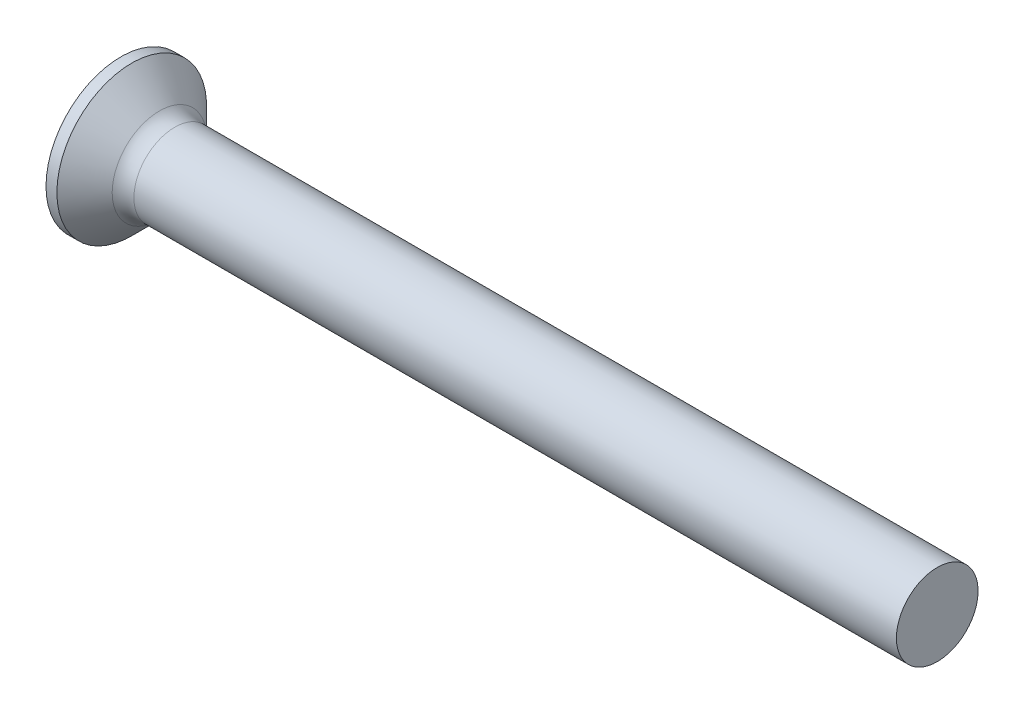
ISO-10303-21;
HEADER;
FILE_DESCRIPTION(('STEP AP214'),'2;1');
FILE_NAME('part.step','',(''),(''),'','','');
FILE_SCHEMA(('AUTOMOTIVE_DESIGN { 1 0 10303 214 1 1 1 1 }'));
ENDSEC;
DATA;
#1=APPLICATION_CONTEXT('core data for automotive mechanical design processes');
#2=APPLICATION_PROTOCOL_DEFINITION('international standard','automotive_design',2000,#1);
#3=PRODUCT_CONTEXT('',#1,'mechanical');
#4=PRODUCT('Part','Part','',(#3));
#5=PRODUCT_RELATED_PRODUCT_CATEGORY('part','',(#4));
#6=PRODUCT_DEFINITION_FORMATION('','',#4);
#7=PRODUCT_DEFINITION_CONTEXT('part definition',#1,'design');
#8=PRODUCT_DEFINITION('design','',#6,#7);
#9=PRODUCT_DEFINITION_SHAPE('','',#8);
#10=(LENGTH_UNIT() NAMED_UNIT(*) SI_UNIT(.MILLI.,.METRE.));
#11=(NAMED_UNIT(*) PLANE_ANGLE_UNIT() SI_UNIT($,.RADIAN.));
#12=(NAMED_UNIT(*) SI_UNIT($,.STERADIAN.) SOLID_ANGLE_UNIT());
#13=UNCERTAINTY_MEASURE_WITH_UNIT(LENGTH_MEASURE(1.E-05),#10,'distance_accuracy_value','');
#14=(GEOMETRIC_REPRESENTATION_CONTEXT(3) GLOBAL_UNCERTAINTY_ASSIGNED_CONTEXT((#13)) GLOBAL_UNIT_ASSIGNED_CONTEXT((#10,
#11,#12)) REPRESENTATION_CONTEXT('',''));
#15=CARTESIAN_POINT('',(0.,0.,0.));
#16=DIRECTION('',(0.,0.,1.));
#17=DIRECTION('',(1.,0.,0.));
#18=AXIS2_PLACEMENT_3D('',#15,#16,#17);
#19=CARTESIAN_POINT('',(2.01,0.370000000000002,-0.49785100239185));
#20=DIRECTION('',(-0.446197800778958,0.,0.89493436774996));
#21=DIRECTION('',(0.89493436774996,0.,0.446197800778958));
#22=AXIS2_PLACEMENT_3D('',#19,#20,#21);
#23=PLANE('',#22);
#24=DIRECTION('',(0.,1.,0.));
#25=VECTOR('',#24,1.);
#26=CARTESIAN_POINT('',(0.,0.370000000000002,-1.5));
#27=LINE('',#26,#25);
#28=CARTESIAN_POINT('',(0.,0.370000000000005,-1.5));
#29=VERTEX_POINT('',#28);
#30=CARTESIAN_POINT('',(0.,-0.369999999999995,-1.5));
#31=VERTEX_POINT('',#30);
#32=EDGE_CURVE('E175',#29,#31,#27,.F.);
#33=ORIENTED_EDGE('',*,*,#32,.T.);
#34=DIRECTION('',(-0.89493436774996,0.,-0.446197800778958));
#35=VECTOR('',#34,1.);
#36=CARTESIAN_POINT('',(2.01,-0.369999999999999,-0.497851002391852));
#37=LINE('',#36,#35);
#38=CARTESIAN_POINT('',(2.01,-0.369999999999998,-0.497851002391852));
#39=VERTEX_POINT('',#38);
#40=EDGE_CURVE('E203',#39,#31,#37,.T.);
#41=ORIENTED_EDGE('',*,*,#40,.F.);
#42=DIRECTION('',(0.,1.,0.));
#43=VECTOR('',#42,1.);
#44=CARTESIAN_POINT('',(2.01,0.370000000000002,-0.49785100239185));
#45=LINE('',#44,#43);
#46=CARTESIAN_POINT('',(2.00999999999998,-0.247548741500632,-0.497851002391852));
#47=VERTEX_POINT('',#46);
#48=EDGE_CURVE('E186',#39,#47,#45,.T.);
#49=ORIENTED_EDGE('',*,*,#48,.T.);
#50=CARTESIAN_POINT('',(2.86902882958261,0.,-0.0695550419526875));
#51=DIRECTION('',(-0.446197800778958,0.,0.89493436774996));
#52=DIRECTION('',(-0.89493436774996,0.,-0.446197800778958));
#53=AXIS2_PLACEMENT_3D('',#50,#51,#52);
#54=ELLIPSE('',#53,1.11145965244602,0.491029028343212);
#55=CARTESIAN_POINT('',(2.01,0.247548741500636,-0.497851002391851));
#56=VERTEX_POINT('',#55);
#57=EDGE_CURVE('E20',#47,#56,#54,.F.);
#58=ORIENTED_EDGE('',*,*,#57,.T.);
#59=DIRECTION('',(0.,1.,0.));
#60=VECTOR('',#59,1.);
#61=CARTESIAN_POINT('',(2.01,0.370000000000002,-0.49785100239185));
#62=LINE('',#61,#60);
#63=CARTESIAN_POINT('',(2.01,0.370000000000002,-0.49785100239185));
#64=VERTEX_POINT('',#63);
#65=EDGE_CURVE('E167',#56,#64,#62,.T.);
#66=ORIENTED_EDGE('',*,*,#65,.T.);
#67=DIRECTION('',(0.89493436774996,0.,0.446197800778958));
#68=VECTOR('',#67,1.);
#69=CARTESIAN_POINT('',(0.,0.370000000000005,-1.5));
#70=LINE('',#69,#68);
#71=EDGE_CURVE('E193',#29,#64,#70,.T.);
#72=ORIENTED_EDGE('',*,*,#71,.F.);
#73=EDGE_LOOP('',(#33,#41,#49,#58,#66,#72));
#74=FACE_BOUND('',#73,.T.);
#75=ADVANCED_FACE('F17',(#74),#23,.T.);
#76=CARTESIAN_POINT('',(2.01,-0.369999999999999,-0.497851002391852));
#77=DIRECTION('',(0.,1.,0.));
#78=DIRECTION('',(0.,0.,1.));
#79=AXIS2_PLACEMENT_3D('',#76,#77,#78);
#80=PLANE('',#79);
#81=DIRECTION('',(0.,0.,1.));
#82=VECTOR('',#81,1.);
#83=CARTESIAN_POINT('',(2.01,-0.369999999999999,-0.497851002391852));
#84=LINE('',#83,#82);
#85=CARTESIAN_POINT('',(2.00999999999215,-0.369999999999999,-0.415013252802522));
#86=VERTEX_POINT('',#85);
#87=EDGE_CURVE('E206',#86,#39,#84,.F.);
#88=ORIENTED_EDGE('',*,*,#87,.T.);
#89=ORIENTED_EDGE('',*,*,#40,.T.);
#90=DIRECTION('',(0.,0.,1.));
#91=VECTOR('',#90,1.);
#92=CARTESIAN_POINT('',(0.,-0.369999999999999,-0.497851002391852));
#93=LINE('',#92,#91);
#94=CARTESIAN_POINT('',(0.,-0.369999999999998,-0.590157547919396));
#95=VERTEX_POINT('',#94);
#96=EDGE_CURVE('E200',#31,#95,#93,.T.);
#97=ORIENTED_EDGE('',*,*,#96,.T.);
#98=CARTESIAN_POINT('',(1.8304273123974E-13,-0.369999999999998,-0.590157547919381));
#99=CARTESIAN_POINT('',(0.216309052140947,-0.369999999999998,-0.572289577009795));
#100=CARTESIAN_POINT('',(0.432602407240752,-0.369999999999998,-0.55422283720754));
#101=CARTESIAN_POINT('',(0.865134686024455,-0.369999999999999,-0.51747646673141));
#102=CARTESIAN_POINT('',(1.08137361024975,-0.369999999999999,-0.498796842417631));
#103=CARTESIAN_POINT('',(1.41633940967486,-0.369999999999999,-0.469214323587316));
#104=CARTESIAN_POINT('',(1.53509176406674,-0.369999999999999,-0.458600717042247));
#105=CARTESIAN_POINT('',(1.77256859362964,-0.369999999999999,-0.437058976884605));
#106=CARTESIAN_POINT('',(1.89129306863835,-0.369999999999999,-0.426130841484444));
#107=CARTESIAN_POINT('',(2.00999999999512,-0.369999999999999,-0.41501325280501));
#108=B_SPLINE_CURVE_WITH_KNOTS('',3,(#98,#99,#100,#101,#102,#103,#104,#105,#106,#107),
.UNSPECIFIED.,.F.,.F.,(4,2,2,2,4),(0.,0.651138391205932,1.30227002747919,1.65994677859564,
2.01762556292617),.UNSPECIFIED.);
#109=EDGE_CURVE('E444',#95,#86,#108,.T.);
#110=ORIENTED_EDGE('',*,*,#109,.T.);
#111=EDGE_LOOP('',(#88,#89,#97,#110));
#112=FACE_BOUND('',#111,.T.);
#113=ADVANCED_FACE('F462',(#112),#80,.T.);
#114=CARTESIAN_POINT('',(2.01,0.369999999999998,0.497851002391852));
#115=DIRECTION('',(0.,-1.,0.));
#116=DIRECTION('',(0.,0.,-1.));
#117=AXIS2_PLACEMENT_3D('',#114,#115,#116);
#118=PLANE('',#117);
#119=DIRECTION('',(0.,0.,-1.));
#120=VECTOR('',#119,1.);
#121=CARTESIAN_POINT('',(0.,0.369999999999998,0.497851002391852));
#122=LINE('',#121,#120);
#123=CARTESIAN_POINT('',(0.,0.370000000000001,-0.590157547919387));
#124=VERTEX_POINT('',#123);
#125=EDGE_CURVE('E196',#124,#29,#122,.T.);
#126=ORIENTED_EDGE('',*,*,#125,.T.);
#127=ORIENTED_EDGE('',*,*,#71,.T.);
#128=DIRECTION('',(0.,0.,-1.));
#129=VECTOR('',#128,1.);
#130=CARTESIAN_POINT('',(2.01,0.369999999999998,0.497851002391852));
#131=LINE('',#130,#129);
#132=CARTESIAN_POINT('',(2.00999999999215,0.370000000000002,-0.41501325280252));
#133=VERTEX_POINT('',#132);
#134=EDGE_CURVE('E171',#64,#133,#131,.F.);
#135=ORIENTED_EDGE('',*,*,#134,.T.);
#136=CARTESIAN_POINT('',(2.00999999999499,0.370000000000002,-0.415013252803601));
#137=CARTESIAN_POINT('',(1.83750309020829,0.370000000000002,-0.431158569065824));
#138=CARTESIAN_POINT('',(1.66497088180432,0.370000000000002,-0.446919712843423));
#139=CARTESIAN_POINT('',(1.31985329581661,0.370000000000002,-0.477835113087158));
#140=CARTESIAN_POINT('',(1.14726791863695,0.370000000000002,-0.492989374056398));
#141=CARTESIAN_POINT('',(0.812249302666097,0.370000000000002,-0.521971147103273));
#142=CARTESIAN_POINT('',(0.649818258439769,0.370000000000001,-0.535824167251821));
#143=CARTESIAN_POINT('',(0.324928129773506,0.370000000000001,-0.563211285368423));
#144=CARTESIAN_POINT('',(0.162469045147424,0.370000000000001,-0.576745381130288));
#145=CARTESIAN_POINT('',(2.04026034606491E-13,0.370000000000001,-0.590157547919622));
#146=B_SPLINE_CURVE_WITH_KNOTS('',3,(#136,#137,#138,#139,#140,#141,#142,#143,#144,#145),
.UNSPECIFIED.,.F.,.F.,(4,2,2,2,4),(0.,0.519751169069005,1.03949848084209,1.52856030580364,
2.01762551290344),.UNSPECIFIED.);
#147=EDGE_CURVE('E441',#133,#124,#146,.T.);
#148=ORIENTED_EDGE('',*,*,#147,.T.);
#149=EDGE_LOOP('',(#126,#127,#135,#148));
#150=FACE_BOUND('',#149,.T.);
#151=ADVANCED_FACE('F483',(#150),#118,.T.);
#152=CARTESIAN_POINT('',(0.,0.,0.));
#153=DIRECTION('',(-1.,0.,0.));
#154=DIRECTION('',(0.,0.,1.));
#155=AXIS2_PLACEMENT_3D('',#152,#153,#154);
#156=CONICAL_SURFACE('',#155,0.696552892009095,0.0698131700800835);
#157=ORIENTED_EDGE('',*,*,#109,.F.);
#158=CARTESIAN_POINT('',(0.,0.,0.));
#159=DIRECTION('',(-1.,0.,0.));
#160=DIRECTION('',(0.,0.,1.));
#161=AXIS2_PLACEMENT_3D('',#158,#159,#160);
#162=CIRCLE('',#161,0.696552892009095);
#163=CARTESIAN_POINT('',(0.,-0.590157547919396,-0.369999999999999));
#164=VERTEX_POINT('',#163);
#165=EDGE_CURVE('E195',#164,#95,#162,.F.);
#166=ORIENTED_EDGE('',*,*,#165,.F.);
#167=CARTESIAN_POINT('',(2.00999999999762,-0.415013252803356,-0.37));
#168=CARTESIAN_POINT('',(1.83750309021098,-0.431158569065578,-0.37));
#169=CARTESIAN_POINT('',(1.66497088180707,-0.446919712843175,-0.37));
#170=CARTESIAN_POINT('',(1.31985329581947,-0.477835113086907,-0.37));
#171=CARTESIAN_POINT('',(1.14726791863987,-0.492989374056144,-0.37));
#172=CARTESIAN_POINT('',(0.812249302668581,-0.521971147103062,-0.37));
#173=CARTESIAN_POINT('',(0.649818258441765,-0.535824167251653,-0.37));
#174=CARTESIAN_POINT('',(0.324928129774522,-0.563211285368339,-0.37));
#175=CARTESIAN_POINT('',(0.162469045147951,-0.576745381130245,-0.369999999999999));
#176=CARTESIAN_POINT('',(2.40997336507689E-13,-0.59015754791962,-0.369999999999999));
#177=B_SPLINE_CURVE_WITH_KNOTS('',3,(#167,#168,#169,#170,#171,#172,#173,#174,#175,#176),
.UNSPECIFIED.,.F.,.F.,(4,2,2,2,4),(0.,0.519751169068833,1.03949848084174,1.52856030580477,
2.01762551290604),.UNSPECIFIED.);
#178=CARTESIAN_POINT('',(2.00999999999215,-0.415013252802521,-0.37));
#179=VERTEX_POINT('',#178);
#180=EDGE_CURVE('E431',#179,#164,#177,.T.);
#181=ORIENTED_EDGE('',*,*,#180,.F.);
#182=CARTESIAN_POINT('',(2.0099999999843,0.,0.));
#183=DIRECTION('',(-1.,0.,0.));
#184=DIRECTION('',(0.,0.,1.));
#185=AXIS2_PLACEMENT_3D('',#182,#183,#184);
#186=CIRCLE('',#185,0.55600000000311);
#187=EDGE_CURVE('E442',#86,#179,#186,.T.);
#188=ORIENTED_EDGE('',*,*,#187,.F.);
#189=EDGE_LOOP('',(#157,#166,#181,#188));
#190=FACE_BOUND('',#189,.T.);
#191=ADVANCED_FACE('F465',(#190),#156,.F.);
#192=CARTESIAN_POINT('',(0.,0.,0.));
#193=DIRECTION('',(-1.,0.,0.));
#194=DIRECTION('',(0.,0.,1.));
#195=AXIS2_PLACEMENT_3D('',#192,#193,#194);
#196=CONICAL_SURFACE('',#195,0.696552892009095,0.0698131700800835);
#197=ORIENTED_EDGE('',*,*,#147,.F.);
#198=CARTESIAN_POINT('',(2.0099999999843,0.,0.));
#199=DIRECTION('',(-1.,0.,0.));
#200=DIRECTION('',(0.,0.,1.));
#201=AXIS2_PLACEMENT_3D('',#198,#199,#200);
#202=CIRCLE('',#201,0.55600000000311);
#203=CARTESIAN_POINT('',(2.00999999999215,0.415013252802521,-0.37));
#204=VERTEX_POINT('',#203);
#205=EDGE_CURVE('E179',#204,#133,#202,.T.);
#206=ORIENTED_EDGE('',*,*,#205,.F.);
#207=CARTESIAN_POINT('',(2.19921746085999E-13,0.590157547919377,-0.369999999999999));
#208=CARTESIAN_POINT('',(0.216309052140984,0.572289577009791,-0.369999999999999));
#209=CARTESIAN_POINT('',(0.432602407240787,0.554222837207536,-0.37));
#210=CARTESIAN_POINT('',(0.865134686024488,0.517476466731406,-0.37));
#211=CARTESIAN_POINT('',(1.08137361024978,0.498796842417628,-0.37));
#212=CARTESIAN_POINT('',(1.41633940967533,0.469214323587274,-0.37));
#213=CARTESIAN_POINT('',(1.53509176406764,0.458600717042166,-0.37));
#214=CARTESIAN_POINT('',(1.77256859363141,0.437058976884443,-0.37));
#215=CARTESIAN_POINT('',(1.89129306864055,0.426130841484241,-0.37));
#216=CARTESIAN_POINT('',(2.00999999999775,0.415013252804763,-0.37));
#217=B_SPLINE_CURVE_WITH_KNOTS('',3,(#207,#208,#209,#210,#211,#212,#213,#214,#215,#216),
.UNSPECIFIED.,.F.,.F.,(4,2,2,2,4),(0.,0.65113839120593,1.30227002747919,1.65994677859694,
2.01762556292877),.UNSPECIFIED.);
#218=CARTESIAN_POINT('',(1.09961796321834E-13,0.590157547919387,-0.369999999999999));
#219=VERTEX_POINT('',#218);
#220=EDGE_CURVE('E421',#219,#204,#217,.T.);
#221=ORIENTED_EDGE('',*,*,#220,.F.);
#222=CARTESIAN_POINT('',(0.,0.,0.));
#223=DIRECTION('',(-1.,0.,0.));
#224=DIRECTION('',(0.,0.,1.));
#225=AXIS2_PLACEMENT_3D('',#222,#223,#224);
#226=CIRCLE('',#225,0.696552892009095);
#227=EDGE_CURVE('E437',#124,#219,#226,.F.);
#228=ORIENTED_EDGE('',*,*,#227,.F.);
#229=EDGE_LOOP('',(#197,#206,#221,#228));
#230=FACE_BOUND('',#229,.T.);
#231=ADVANCED_FACE('F490',(#230),#196,.F.);
#232=CARTESIAN_POINT('',(2.01,0.497851002391851,-0.37));
#233=DIRECTION('',(0.,0.,1.));
#234=DIRECTION('',(1.,0.,0.));
#235=AXIS2_PLACEMENT_3D('',#232,#233,#234);
#236=PLANE('',#235);
#237=DIRECTION('',(0.,1.,0.));
#238=VECTOR('',#237,1.);
#239=CARTESIAN_POINT('',(0.,0.497851002391851,-0.369999999999999));
#240=LINE('',#239,#238);
#241=CARTESIAN_POINT('',(0.,-1.5,-0.37));
#242=VERTEX_POINT('',#241);
#243=EDGE_CURVE('E427',#164,#242,#240,.F.);
#244=ORIENTED_EDGE('',*,*,#243,.T.);
#245=DIRECTION('',(-0.89493436774996,-0.446197800778958,0.));
#246=VECTOR('',#245,1.);
#247=CARTESIAN_POINT('',(2.01,-0.497851002391851,-0.37));
#248=LINE('',#247,#246);
#249=CARTESIAN_POINT('',(2.01,-0.497851002391851,-0.37));
#250=VERTEX_POINT('',#249);
#251=EDGE_CURVE('E408',#250,#242,#248,.T.);
#252=ORIENTED_EDGE('',*,*,#251,.F.);
#253=DIRECTION('',(0.,1.,0.));
#254=VECTOR('',#253,1.);
#255=CARTESIAN_POINT('',(2.01,0.497851002391851,-0.37));
#256=LINE('',#255,#254);
#257=EDGE_CURVE('E434',#250,#179,#256,.T.);
#258=ORIENTED_EDGE('',*,*,#257,.T.);
#259=ORIENTED_EDGE('',*,*,#180,.T.);
#260=EDGE_LOOP('',(#244,#252,#258,#259));
#261=FACE_BOUND('',#260,.T.);
#262=ADVANCED_FACE('F532',(#261),#236,.T.);
#263=CARTESIAN_POINT('',(2.01,0.497851002391851,-0.37));
#264=DIRECTION('',(0.,0.,1.));
#265=DIRECTION('',(1.,0.,0.));
#266=AXIS2_PLACEMENT_3D('',#263,#264,#265);
#267=PLANE('',#266);
#268=DIRECTION('',(0.,1.,0.));
#269=VECTOR('',#268,1.);
#270=CARTESIAN_POINT('',(2.01,0.497851002391851,-0.37));
#271=LINE('',#270,#269);
#272=CARTESIAN_POINT('',(2.01,0.497851002391851,-0.37));
#273=VERTEX_POINT('',#272);
#274=EDGE_CURVE('E413',#204,#273,#271,.T.);
#275=ORIENTED_EDGE('',*,*,#274,.T.);
#276=DIRECTION('',(0.89493436774996,-0.446197800778958,0.));
#277=VECTOR('',#276,1.);
#278=CARTESIAN_POINT('',(2.01,0.497851002391851,-0.37));
#279=LINE('',#278,#277);
#280=CARTESIAN_POINT('',(0.,1.5,-0.37));
#281=VERTEX_POINT('',#280);
#282=EDGE_CURVE('E389',#281,#273,#279,.T.);
#283=ORIENTED_EDGE('',*,*,#282,.F.);
#284=DIRECTION('',(0.,1.,0.));
#285=VECTOR('',#284,1.);
#286=CARTESIAN_POINT('',(0.,0.497851002391851,-0.369999999999999));
#287=LINE('',#286,#285);
#288=EDGE_CURVE('E424',#281,#219,#287,.F.);
#289=ORIENTED_EDGE('',*,*,#288,.T.);
#290=ORIENTED_EDGE('',*,*,#220,.T.);
#291=EDGE_LOOP('',(#275,#283,#289,#290));
#292=FACE_BOUND('',#291,.T.);
#293=ADVANCED_FACE('F527',(#292),#267,.T.);
#294=CARTESIAN_POINT('',(2.01,-0.497851002391851,-0.37));
#295=DIRECTION('',(-0.446197800778958,0.89493436774996,0.));
#296=DIRECTION('',(-0.89493436774996,-0.446197800778958,0.));
#297=AXIS2_PLACEMENT_3D('',#294,#295,#296);
#298=PLANE('',#297);
#299=DIRECTION('',(0.,0.,1.));
#300=VECTOR('',#299,1.);
#301=CARTESIAN_POINT('',(0.,-1.5,-0.37));
#302=LINE('',#301,#300);
#303=CARTESIAN_POINT('',(0.,-1.5,0.37));
#304=VERTEX_POINT('',#303);
#305=EDGE_CURVE('E399',#242,#304,#302,.T.);
#306=ORIENTED_EDGE('',*,*,#305,.T.);
#307=DIRECTION('',(-0.89493436774996,-0.446197800778958,0.));
#308=VECTOR('',#307,1.);
#309=CARTESIAN_POINT('',(2.01,-0.497851002391851,0.37));
#310=LINE('',#309,#308);
#311=CARTESIAN_POINT('',(2.01,-0.497851002391851,0.37));
#312=VERTEX_POINT('',#311);
#313=EDGE_CURVE('E349',#312,#304,#310,.T.);
#314=ORIENTED_EDGE('',*,*,#313,.F.);
#315=DIRECTION('',(0.,0.,-1.));
#316=VECTOR('',#315,1.);
#317=CARTESIAN_POINT('',(2.01,-0.497851002391851,-0.37));
#318=LINE('',#317,#316);
#319=CARTESIAN_POINT('',(2.01,-0.497851002391851,0.247548741500634));
#320=VERTEX_POINT('',#319);
#321=EDGE_CURVE('E374',#312,#320,#318,.T.);
#322=ORIENTED_EDGE('',*,*,#321,.T.);
#323=CARTESIAN_POINT('',(2.86902882958261,-0.0695550419526873,0.));
#324=DIRECTION('',(-0.446197800778958,0.89493436774996,0.));
#325=DIRECTION('',(-0.89493436774996,-0.446197800778958,0.));
#326=AXIS2_PLACEMENT_3D('',#323,#324,#325);
#327=ELLIPSE('',#326,1.11145965244602,0.491029028343212);
#328=CARTESIAN_POINT('',(2.00999999999998,-0.497851002391852,-0.247548741500634));
#329=VERTEX_POINT('',#328);
#330=EDGE_CURVE('E366',#320,#329,#327,.F.);
#331=ORIENTED_EDGE('',*,*,#330,.T.);
#332=DIRECTION('',(0.,0.,-1.));
#333=VECTOR('',#332,1.);
#334=CARTESIAN_POINT('',(2.01,-0.497851002391851,-0.37));
#335=LINE('',#334,#333);
#336=EDGE_CURVE('E359',#329,#250,#335,.T.);
#337=ORIENTED_EDGE('',*,*,#336,.T.);
#338=ORIENTED_EDGE('',*,*,#251,.T.);
#339=EDGE_LOOP('',(#306,#314,#322,#331,#337,#338));
#340=FACE_BOUND('',#339,.T.);
#341=ADVANCED_FACE('F531',(#340),#298,.T.);
#342=CARTESIAN_POINT('',(2.01,0.497851002391851,0.37));
#343=DIRECTION('',(-0.446197800778958,-0.89493436774996,0.));
#344=DIRECTION('',(0.89493436774996,-0.446197800778958,0.));
#345=AXIS2_PLACEMENT_3D('',#342,#343,#344);
#346=PLANE('',#345);
#347=DIRECTION('',(0.,0.,1.));
#348=VECTOR('',#347,1.);
#349=CARTESIAN_POINT('',(0.,1.5,0.37));
#350=LINE('',#349,#348);
#351=CARTESIAN_POINT('',(0.,1.5,0.37));
#352=VERTEX_POINT('',#351);
#353=EDGE_CURVE('E396',#352,#281,#350,.F.);
#354=ORIENTED_EDGE('',*,*,#353,.T.);
#355=ORIENTED_EDGE('',*,*,#282,.T.);
#356=DIRECTION('',(0.,0.,-1.));
#357=VECTOR('',#356,1.);
#358=CARTESIAN_POINT('',(2.01,0.497851002391851,-0.37));
#359=LINE('',#358,#357);
#360=CARTESIAN_POINT('',(2.01,0.497851002391851,-0.247548741500634));
#361=VERTEX_POINT('',#360);
#362=EDGE_CURVE('E387',#273,#361,#359,.F.);
#363=ORIENTED_EDGE('',*,*,#362,.T.);
#364=CARTESIAN_POINT('',(2.86902882958261,0.0695550419526879,0.));
#365=DIRECTION('',(-0.446197800778958,-0.89493436774996,0.));
#366=DIRECTION('',(-0.89493436774996,0.446197800778958,0.));
#367=AXIS2_PLACEMENT_3D('',#364,#365,#366);
#368=ELLIPSE('',#367,1.11145965244602,0.491029028343212);
#369=CARTESIAN_POINT('',(2.00999999999998,0.497851002391852,0.247548741500634));
#370=VERTEX_POINT('',#369);
#371=EDGE_CURVE('E380',#361,#370,#368,.F.);
#372=ORIENTED_EDGE('',*,*,#371,.T.);
#373=DIRECTION('',(0.,0.,-1.));
#374=VECTOR('',#373,1.);
#375=CARTESIAN_POINT('',(2.01,0.497851002391851,-0.37));
#376=LINE('',#375,#374);
#377=CARTESIAN_POINT('',(2.01,0.497851002391851,0.37));
#378=VERTEX_POINT('',#377);
#379=EDGE_CURVE('E376',#370,#378,#376,.F.);
#380=ORIENTED_EDGE('',*,*,#379,.T.);
#381=DIRECTION('',(0.89493436774996,-0.446197800778958,0.));
#382=VECTOR('',#381,1.);
#383=CARTESIAN_POINT('',(0.,1.5,0.37));
#384=LINE('',#383,#382);
#385=EDGE_CURVE('E181',#352,#378,#384,.T.);
#386=ORIENTED_EDGE('',*,*,#385,.F.);
#387=EDGE_LOOP('',(#354,#355,#363,#372,#380,#386));
#388=FACE_BOUND('',#387,.T.);
#389=ADVANCED_FACE('F583',(#388),#346,.T.);
#390=CARTESIAN_POINT('',(2.01,0.497851002391851,-0.37));
#391=DIRECTION('',(1.,0.,0.));
#392=DIRECTION('',(0.,0.,-1.));
#393=AXIS2_PLACEMENT_3D('',#390,#391,#392);
#394=PLANE('',#393);
#395=ORIENTED_EDGE('',*,*,#134,.F.);
#396=ORIENTED_EDGE('',*,*,#65,.F.);
#397=CARTESIAN_POINT('',(2.01,0.,0.));
#398=DIRECTION('',(-1.,0.,0.));
#399=DIRECTION('',(0.,0.,1.));
#400=AXIS2_PLACEMENT_3D('',#397,#398,#399);
#401=CIRCLE('',#400,0.556000000000001);
#402=EDGE_CURVE('E169',#56,#133,#401,.F.);
#403=ORIENTED_EDGE('',*,*,#402,.T.);
#404=EDGE_LOOP('',(#395,#396,#403));
#405=FACE_BOUND('',#404,.T.);
#406=ADVANCED_FACE('F168',(#405),#394,.F.);
#407=CARTESIAN_POINT('',(2.01,0.497851002391851,-0.37));
#408=DIRECTION('',(1.,0.,0.));
#409=DIRECTION('',(0.,0.,-1.));
#410=AXIS2_PLACEMENT_3D('',#407,#408,#409);
#411=PLANE('',#410);
#412=ORIENTED_EDGE('',*,*,#362,.F.);
#413=ORIENTED_EDGE('',*,*,#274,.F.);
#414=CARTESIAN_POINT('',(2.01,0.,0.));
#415=DIRECTION('',(-1.,0.,0.));
#416=DIRECTION('',(0.,0.,1.));
#417=AXIS2_PLACEMENT_3D('',#414,#415,#416);
#418=CIRCLE('',#417,0.556000000000001);
#419=EDGE_CURVE('E180',#204,#361,#418,.F.);
#420=ORIENTED_EDGE('',*,*,#419,.T.);
#421=EDGE_LOOP('',(#412,#413,#420));
#422=FACE_BOUND('',#421,.T.);
#423=ADVANCED_FACE('F577',(#422),#411,.F.);
#424=CARTESIAN_POINT('',(1.87352457248835,0.,0.));
#425=DIRECTION('',(-1.,0.,0.));
#426=DIRECTION('',(0.,-1.,0.));
#427=AXIS2_PLACEMENT_3D('',#424,#425,#426);
#428=CONICAL_SURFACE('',#427,0.565543291557447,0.069813170086462);
#429=ORIENTED_EDGE('',*,*,#371,.F.);
#430=CARTESIAN_POINT('',(2.00999999999996,0.,0.));
#431=DIRECTION('',(-1.,0.,0.));
#432=DIRECTION('',(0.,0.,1.));
#433=AXIS2_PLACEMENT_3D('',#430,#431,#432);
#434=CIRCLE('',#433,0.556000000000001);
#435=EDGE_CURVE('E383',#361,#370,#434,.F.);
#436=ORIENTED_EDGE('',*,*,#435,.T.);
#437=EDGE_LOOP('',(#429,#436));
#438=FACE_BOUND('',#437,.T.);
#439=ADVANCED_FACE('F573',(#438),#428,.F.);
#440=CARTESIAN_POINT('',(2.01,0.497851002391851,-0.37));
#441=DIRECTION('',(1.,0.,0.));
#442=DIRECTION('',(0.,0.,-1.));
#443=AXIS2_PLACEMENT_3D('',#440,#441,#442);
#444=PLANE('',#443);
#445=DIRECTION('',(0.,1.,0.));
#446=VECTOR('',#445,1.);
#447=CARTESIAN_POINT('',(2.01,-0.497851002391851,0.37));
#448=LINE('',#447,#446);
#449=CARTESIAN_POINT('',(2.00999999999215,0.415013252802521,0.370000000000001));
#450=VERTEX_POINT('',#449);
#451=EDGE_CURVE('E344',#378,#450,#448,.F.);
#452=ORIENTED_EDGE('',*,*,#451,.F.);
#453=ORIENTED_EDGE('',*,*,#379,.F.);
#454=CARTESIAN_POINT('',(2.01,0.,0.));
#455=DIRECTION('',(-1.,0.,0.));
#456=DIRECTION('',(0.,0.,1.));
#457=AXIS2_PLACEMENT_3D('',#454,#455,#456);
#458=CIRCLE('',#457,0.556000000000001);
#459=EDGE_CURVE('E386',#370,#450,#458,.F.);
#460=ORIENTED_EDGE('',*,*,#459,.T.);
#461=EDGE_LOOP('',(#452,#453,#460));
#462=FACE_BOUND('',#461,.T.);
#463=ADVANCED_FACE('F566',(#462),#444,.F.);
#464=CARTESIAN_POINT('',(2.01,0.497851002391851,-0.37));
#465=DIRECTION('',(1.,0.,0.));
#466=DIRECTION('',(0.,0.,-1.));
#467=AXIS2_PLACEMENT_3D('',#464,#465,#466);
#468=PLANE('',#467);
#469=ORIENTED_EDGE('',*,*,#321,.F.);
#470=DIRECTION('',(0.,1.,0.));
#471=VECTOR('',#470,1.);
#472=CARTESIAN_POINT('',(2.01,-0.497851002391851,0.37));
#473=LINE('',#472,#471);
#474=CARTESIAN_POINT('',(2.00999999999215,-0.415013252802521,0.370000000000001));
#475=VERTEX_POINT('',#474);
#476=EDGE_CURVE('E352',#475,#312,#473,.F.);
#477=ORIENTED_EDGE('',*,*,#476,.F.);
#478=CARTESIAN_POINT('',(2.01,0.,0.));
#479=DIRECTION('',(-1.,0.,0.));
#480=DIRECTION('',(0.,0.,1.));
#481=AXIS2_PLACEMENT_3D('',#478,#479,#480);
#482=CIRCLE('',#481,0.556000000000001);
#483=EDGE_CURVE('E373',#475,#320,#482,.F.);
#484=ORIENTED_EDGE('',*,*,#483,.T.);
#485=EDGE_LOOP('',(#469,#477,#484));
#486=FACE_BOUND('',#485,.T.);
#487=ADVANCED_FACE('F559',(#486),#468,.F.);
#488=CARTESIAN_POINT('',(1.87352457248835,0.,0.));
#489=DIRECTION('',(-1.,0.,0.));
#490=DIRECTION('',(0.,-1.,0.));
#491=AXIS2_PLACEMENT_3D('',#488,#489,#490);
#492=CONICAL_SURFACE('',#491,0.565543291557447,0.069813170086462);
#493=ORIENTED_EDGE('',*,*,#330,.F.);
#494=CARTESIAN_POINT('',(2.00999999999996,0.,0.));
#495=DIRECTION('',(-1.,0.,0.));
#496=DIRECTION('',(0.,0.,1.));
#497=AXIS2_PLACEMENT_3D('',#494,#495,#496);
#498=CIRCLE('',#497,0.556000000000001);
#499=EDGE_CURVE('E369',#320,#329,#498,.F.);
#500=ORIENTED_EDGE('',*,*,#499,.T.);
#501=EDGE_LOOP('',(#493,#500));
#502=FACE_BOUND('',#501,.T.);
#503=ADVANCED_FACE('F557',(#502),#492,.F.);
#504=CARTESIAN_POINT('',(2.01,0.497851002391851,-0.37));
#505=DIRECTION('',(1.,0.,0.));
#506=DIRECTION('',(0.,0.,-1.));
#507=AXIS2_PLACEMENT_3D('',#504,#505,#506);
#508=PLANE('',#507);
#509=ORIENTED_EDGE('',*,*,#257,.F.);
#510=ORIENTED_EDGE('',*,*,#336,.F.);
#511=CARTESIAN_POINT('',(2.01,0.,0.));
#512=DIRECTION('',(-1.,0.,0.));
#513=DIRECTION('',(0.,0.,1.));
#514=AXIS2_PLACEMENT_3D('',#511,#512,#513);
#515=CIRCLE('',#514,0.556000000000001);
#516=EDGE_CURVE('E372',#329,#179,#515,.F.);
#517=ORIENTED_EDGE('',*,*,#516,.T.);
#518=EDGE_LOOP('',(#509,#510,#517));
#519=FACE_BOUND('',#518,.T.);
#520=ADVANCED_FACE('F552',(#519),#508,.F.);
#521=CARTESIAN_POINT('',(2.01,0.497851002391851,-0.37));
#522=DIRECTION('',(1.,0.,0.));
#523=DIRECTION('',(0.,0.,-1.));
#524=AXIS2_PLACEMENT_3D('',#521,#522,#523);
#525=PLANE('',#524);
#526=ORIENTED_EDGE('',*,*,#48,.F.);
#527=ORIENTED_EDGE('',*,*,#87,.F.);
#528=CARTESIAN_POINT('',(2.01,0.,0.));
#529=DIRECTION('',(-1.,0.,0.));
#530=DIRECTION('',(0.,0.,1.));
#531=AXIS2_PLACEMENT_3D('',#528,#529,#530);
#532=CIRCLE('',#531,0.556000000000001);
#533=EDGE_CURVE('E162',#86,#47,#532,.F.);
#534=ORIENTED_EDGE('',*,*,#533,.T.);
#535=EDGE_LOOP('',(#526,#527,#534));
#536=FACE_BOUND('',#535,.T.);
#537=ADVANCED_FACE('F498',(#536),#525,.F.);
#538=CARTESIAN_POINT('',(1.87352457248835,0.,0.));
#539=DIRECTION('',(-1.,0.,0.));
#540=DIRECTION('',(0.,-1.,0.));
#541=AXIS2_PLACEMENT_3D('',#538,#539,#540);
#542=CONICAL_SURFACE('',#541,0.565543291557447,0.069813170086462);
#543=ORIENTED_EDGE('',*,*,#57,.F.);
#544=CARTESIAN_POINT('',(2.00999999999996,0.,0.));
#545=DIRECTION('',(-1.,0.,0.));
#546=DIRECTION('',(0.,0.,1.));
#547=AXIS2_PLACEMENT_3D('',#544,#545,#546);
#548=CIRCLE('',#547,0.556000000000001);
#549=EDGE_CURVE('E154',#47,#56,#548,.F.);
#550=ORIENTED_EDGE('',*,*,#549,.T.);
#551=EDGE_LOOP('',(#543,#550));
#552=FACE_BOUND('',#551,.T.);
#553=ADVANCED_FACE('F156',(#552),#542,.F.);
#554=CARTESIAN_POINT('',(2.01,-0.497851002391851,0.37));
#555=DIRECTION('',(0.,0.,-1.));
#556=DIRECTION('',(-1.,0.,0.));
#557=AXIS2_PLACEMENT_3D('',#554,#555,#556);
#558=PLANE('',#557);
#559=ORIENTED_EDGE('',*,*,#476,.T.);
#560=ORIENTED_EDGE('',*,*,#313,.T.);
#561=DIRECTION('',(0.,1.,0.));
#562=VECTOR('',#561,1.);
#563=CARTESIAN_POINT('',(0.,-0.497851002391851,0.37));
#564=LINE('',#563,#562);
#565=CARTESIAN_POINT('',(0.,-0.590157547919395,0.37));
#566=VERTEX_POINT('',#565);
#567=EDGE_CURVE('E355',#304,#566,#564,.T.);
#568=ORIENTED_EDGE('',*,*,#567,.T.);
#569=CARTESIAN_POINT('',(1.83048456276235E-13,-0.59015754791938,0.37));
#570=CARTESIAN_POINT('',(0.216309052140947,-0.572289577009794,0.37));
#571=CARTESIAN_POINT('',(0.432602407240752,-0.554222837207539,0.37));
#572=CARTESIAN_POINT('',(0.865134686024455,-0.517476466731409,0.37));
#573=CARTESIAN_POINT('',(1.08137361024975,-0.49879684241763,0.37));
#574=CARTESIAN_POINT('',(1.41633940967486,-0.469214323587315,0.37));
#575=CARTESIAN_POINT('',(1.53509176406674,-0.458600717042246,0.37));
#576=CARTESIAN_POINT('',(1.77256859362964,-0.437058976884604,0.37));
#577=CARTESIAN_POINT('',(1.89129306863835,-0.426130841484443,0.37));
#578=CARTESIAN_POINT('',(2.00999999999512,-0.415013252805009,0.37));
#579=B_SPLINE_CURVE_WITH_KNOTS('',3,(#569,#570,#571,#572,#573,#574,#575,#576,#577,#578),
.UNSPECIFIED.,.F.,.F.,(4,2,2,2,4),(0.,0.651138391205932,1.30227002747919,1.65994677859564,
2.01762556292617),.UNSPECIFIED.);
#580=EDGE_CURVE('E161',#566,#475,#579,.T.);
#581=ORIENTED_EDGE('',*,*,#580,.T.);
#582=EDGE_LOOP('',(#559,#560,#568,#581));
#583=FACE_BOUND('',#582,.T.);
#584=ADVANCED_FACE('F616',(#583),#558,.T.);
#585=CARTESIAN_POINT('',(2.01,-0.497851002391851,0.37));
#586=DIRECTION('',(0.,0.,-1.));
#587=DIRECTION('',(-1.,0.,0.));
#588=AXIS2_PLACEMENT_3D('',#585,#586,#587);
#589=PLANE('',#588);
#590=DIRECTION('',(0.,1.,0.));
#591=VECTOR('',#590,1.);
#592=CARTESIAN_POINT('',(0.,-0.497851002391851,0.37));
#593=LINE('',#592,#591);
#594=CARTESIAN_POINT('',(0.,0.590157547919388,0.37));
#595=VERTEX_POINT('',#594);
#596=EDGE_CURVE('E341',#595,#352,#593,.T.);
#597=ORIENTED_EDGE('',*,*,#596,.T.);
#598=ORIENTED_EDGE('',*,*,#385,.T.);
#599=ORIENTED_EDGE('',*,*,#451,.T.);
#600=CARTESIAN_POINT('',(2.00999999999499,0.415013252803602,0.37));
#601=CARTESIAN_POINT('',(1.83750309020829,0.431158569065825,0.37));
#602=CARTESIAN_POINT('',(1.66497088180432,0.446919712843424,0.37));
#603=CARTESIAN_POINT('',(1.31985329581661,0.477835113087159,0.37));
#604=CARTESIAN_POINT('',(1.14726791863695,0.492989374056399,0.37));
#605=CARTESIAN_POINT('',(0.812249302666097,0.521971147103274,0.37));
#606=CARTESIAN_POINT('',(0.649818258439769,0.535824167251822,0.37));
#607=CARTESIAN_POINT('',(0.324928129773506,0.563211285368424,0.37));
#608=CARTESIAN_POINT('',(0.162469045147424,0.576745381130288,0.37));
#609=CARTESIAN_POINT('',(2.04035084014091E-13,0.590157547919622,0.37));
#610=B_SPLINE_CURVE_WITH_KNOTS('',3,(#600,#601,#602,#603,#604,#605,#606,#607,#608,#609),
.UNSPECIFIED.,.F.,.F.,(4,2,2,2,4),(0.,0.519751169069005,1.03949848084209,1.52856030580364,
2.01762551290344),.UNSPECIFIED.);
#611=EDGE_CURVE('E602',#450,#595,#610,.T.);
#612=ORIENTED_EDGE('',*,*,#611,.T.);
#613=EDGE_LOOP('',(#597,#598,#599,#612));
#614=FACE_BOUND('',#613,.T.);
#615=ADVANCED_FACE('F600',(#614),#589,.T.);
#616=CARTESIAN_POINT('',(2.01000000000029,0.,0.));
#617=DIRECTION('',(-1.,0.,0.));
#618=DIRECTION('',(0.,0.,1.));
#619=AXIS2_PLACEMENT_3D('',#616,#617,#618);
#620=CONICAL_SURFACE('',#619,0.555999999999113,1.25663706143445);
#621=CARTESIAN_POINT('',(2.19065535110557,0.,4.44089209850063E-13));
#622=VERTEX_POINT('',#621);
#623=VERTEX_LOOP('',#622);
#624=FACE_BOUND('',#623,.T.);
#625=ORIENTED_EDGE('',*,*,#402,.F.);
#626=ORIENTED_EDGE('',*,*,#549,.F.);
#627=ORIENTED_EDGE('',*,*,#533,.F.);
#628=ORIENTED_EDGE('',*,*,#187,.T.);
#629=ORIENTED_EDGE('',*,*,#516,.F.);
#630=ORIENTED_EDGE('',*,*,#499,.F.);
#631=ORIENTED_EDGE('',*,*,#483,.F.);
#632=CARTESIAN_POINT('',(2.0099999999843,0.,0.));
#633=DIRECTION('',(-1.,0.,0.));
#634=DIRECTION('',(0.,0.,1.));
#635=AXIS2_PLACEMENT_3D('',#632,#633,#634);
#636=CIRCLE('',#635,0.55600000000311);
#637=CARTESIAN_POINT('',(2.00999999999215,-0.370000000000002,0.41501325280252));
#638=VERTEX_POINT('',#637);
#639=EDGE_CURVE('E338',#475,#638,#636,.T.);
#640=ORIENTED_EDGE('',*,*,#639,.T.);
#641=CARTESIAN_POINT('',(2.01,0.,0.));
#642=DIRECTION('',(-1.,0.,0.));
#643=DIRECTION('',(0.,0.,1.));
#644=AXIS2_PLACEMENT_3D('',#641,#642,#643);
#645=CIRCLE('',#644,0.556000000000001);
#646=CARTESIAN_POINT('',(2.00999999999215,-0.247548741496258,0.497851002395763));
#647=VERTEX_POINT('',#646);
#648=EDGE_CURVE('E314',#638,#647,#645,.T.);
#649=ORIENTED_EDGE('',*,*,#648,.T.);
#650=CARTESIAN_POINT('',(2.0099999999843,0.,0.));
#651=DIRECTION('',(-1.,0.,0.));
#652=DIRECTION('',(0.,0.,1.));
#653=AXIS2_PLACEMENT_3D('',#650,#651,#652);
#654=CIRCLE('',#653,0.55600000000311);
#655=CARTESIAN_POINT('',(2.00999999999215,0.247548741496255,0.497851002395765));
#656=VERTEX_POINT('',#655);
#657=EDGE_CURVE('E322',#647,#656,#654,.T.);
#658=ORIENTED_EDGE('',*,*,#657,.T.);
#659=CARTESIAN_POINT('',(2.01,0.,0.));
#660=DIRECTION('',(-1.,0.,0.));
#661=DIRECTION('',(0.,0.,1.));
#662=AXIS2_PLACEMENT_3D('',#659,#660,#661);
#663=CIRCLE('',#662,0.556000000000001);
#664=CARTESIAN_POINT('',(2.00999999999215,0.369999999999999,0.415013252802522));
#665=VERTEX_POINT('',#664);
#666=EDGE_CURVE('E324',#656,#665,#663,.T.);
#667=ORIENTED_EDGE('',*,*,#666,.T.);
#668=CARTESIAN_POINT('',(2.0099999999843,0.,0.));
#669=DIRECTION('',(-1.,0.,0.));
#670=DIRECTION('',(0.,0.,1.));
#671=AXIS2_PLACEMENT_3D('',#668,#669,#670);
#672=CIRCLE('',#671,0.55600000000311);
#673=EDGE_CURVE('E331',#665,#450,#672,.T.);
#674=ORIENTED_EDGE('',*,*,#673,.T.);
#675=ORIENTED_EDGE('',*,*,#459,.F.);
#676=ORIENTED_EDGE('',*,*,#435,.F.);
#677=ORIENTED_EDGE('',*,*,#419,.F.);
#678=ORIENTED_EDGE('',*,*,#205,.T.);
#679=EDGE_LOOP('',(#625,#626,#627,#628,#629,#630,#631,#640,#649,#658,#667,#674,#675,#676,#677,#678));
#680=FACE_BOUND('',#679,.T.);
#681=ADVANCED_FACE('F177',(#624,#680),#620,.F.);
#682=CARTESIAN_POINT('',(0.,0.,0.));
#683=DIRECTION('',(-1.,0.,0.));
#684=DIRECTION('',(0.,0.,1.));
#685=AXIS2_PLACEMENT_3D('',#682,#683,#684);
#686=CONICAL_SURFACE('',#685,0.696552892009095,0.0698131700800835);
#687=CARTESIAN_POINT('',(2.00999999999762,-0.370000000000002,0.415013252803354));
#688=CARTESIAN_POINT('',(1.83750309021098,-0.370000000000002,0.431158569065576));
#689=CARTESIAN_POINT('',(1.66497088180707,-0.370000000000002,0.446919712843173));
#690=CARTESIAN_POINT('',(1.31985329581947,-0.370000000000002,0.477835113086905));
#691=CARTESIAN_POINT('',(1.14726791863987,-0.370000000000002,0.492989374056142));
#692=CARTESIAN_POINT('',(0.812249302668581,-0.370000000000002,0.52197114710306));
#693=CARTESIAN_POINT('',(0.649818258441764,-0.370000000000002,0.535824167251651));
#694=CARTESIAN_POINT('',(0.324928129774522,-0.370000000000002,0.563211285368338));
#695=CARTESIAN_POINT('',(0.16246904514795,-0.370000000000002,0.576745381130244));
#696=CARTESIAN_POINT('',(2.40996697575289E-13,-0.370000000000002,0.590157547919618));
#697=B_SPLINE_CURVE_WITH_KNOTS('',3,(#687,#688,#689,#690,#691,#692,#693,#694,#695,#696),
.UNSPECIFIED.,.F.,.F.,(4,2,2,2,4),(0.,0.519751169068833,1.03949848084174,1.52856030580477,
2.01762551290604),.UNSPECIFIED.);
#698=CARTESIAN_POINT('',(0.,-0.370000000000002,0.590157547919394));
#699=VERTEX_POINT('',#698);
#700=EDGE_CURVE('E231',#638,#699,#697,.T.);
#701=ORIENTED_EDGE('',*,*,#700,.F.);
#702=ORIENTED_EDGE('',*,*,#639,.F.);
#703=ORIENTED_EDGE('',*,*,#580,.F.);
#704=CARTESIAN_POINT('',(0.,0.,0.));
#705=DIRECTION('',(-1.,0.,0.));
#706=DIRECTION('',(0.,0.,1.));
#707=AXIS2_PLACEMENT_3D('',#704,#705,#706);
#708=CIRCLE('',#707,0.696552892009095);
#709=EDGE_CURVE('E340',#699,#566,#708,.F.);
#710=ORIENTED_EDGE('',*,*,#709,.F.);
#711=EDGE_LOOP('',(#701,#702,#703,#710));
#712=FACE_BOUND('',#711,.T.);
#713=ADVANCED_FACE('F267',(#712),#686,.F.);
#714=CARTESIAN_POINT('',(0.,0.,0.));
#715=DIRECTION('',(-1.,0.,0.));
#716=DIRECTION('',(0.,0.,1.));
#717=AXIS2_PLACEMENT_3D('',#714,#715,#716);
#718=CONICAL_SURFACE('',#717,0.696552892009095,0.0698131700800835);
#719=CARTESIAN_POINT('',(2.19921593235588E-13,0.369999999999997,0.590157547919379));
#720=CARTESIAN_POINT('',(0.216309052140984,0.369999999999997,0.572289577009793));
#721=CARTESIAN_POINT('',(0.432602407240787,0.369999999999998,0.554222837207537));
#722=CARTESIAN_POINT('',(0.865134686024488,0.369999999999998,0.517476466731408));
#723=CARTESIAN_POINT('',(1.08137361024978,0.369999999999998,0.498796842417629));
#724=CARTESIAN_POINT('',(1.41633940967533,0.369999999999998,0.469214323587275));
#725=CARTESIAN_POINT('',(1.53509176406764,0.369999999999998,0.458600717042167));
#726=CARTESIAN_POINT('',(1.77256859363141,0.369999999999998,0.437058976884444));
#727=CARTESIAN_POINT('',(1.89129306864055,0.369999999999999,0.426130841484242));
#728=CARTESIAN_POINT('',(2.00999999999775,0.369999999999999,0.415013252804764));
#729=B_SPLINE_CURVE_WITH_KNOTS('',3,(#719,#720,#721,#722,#723,#724,#725,#726,#727,#728),
.UNSPECIFIED.,.F.,.F.,(4,2,2,2,4),(0.,0.65113839120593,1.30227002747919,1.65994677859694,
2.01762556292877),.UNSPECIFIED.);
#730=CARTESIAN_POINT('',(1.09961719896629E-13,0.369999999999997,0.590157547919388));
#731=VERTEX_POINT('',#730);
#732=EDGE_CURVE('E222',#731,#665,#729,.T.);
#733=ORIENTED_EDGE('',*,*,#732,.F.);
#734=CARTESIAN_POINT('',(0.,0.,0.));
#735=DIRECTION('',(-1.,0.,0.));
#736=DIRECTION('',(0.,0.,1.));
#737=AXIS2_PLACEMENT_3D('',#734,#735,#736);
#738=CIRCLE('',#737,0.696552892009095);
#739=EDGE_CURVE('E334',#595,#731,#738,.F.);
#740=ORIENTED_EDGE('',*,*,#739,.F.);
#741=ORIENTED_EDGE('',*,*,#611,.F.);
#742=ORIENTED_EDGE('',*,*,#673,.F.);
#743=EDGE_LOOP('',(#733,#740,#741,#742));
#744=FACE_BOUND('',#743,.T.);
#745=ADVANCED_FACE('F238',(#744),#718,.F.);
#746=CARTESIAN_POINT('',(2.01,0.497851002391851,-0.37));
#747=DIRECTION('',(1.,0.,0.));
#748=DIRECTION('',(0.,0.,-1.));
#749=AXIS2_PLACEMENT_3D('',#746,#747,#748);
#750=PLANE('',#749);
#751=DIRECTION('',(0.,1.,0.));
#752=VECTOR('',#751,1.);
#753=CARTESIAN_POINT('',(2.01,-0.370000000000002,0.49785100239185));
#754=LINE('',#753,#752);
#755=CARTESIAN_POINT('',(2.01,0.369999999999996,0.497851002391852));
#756=VERTEX_POINT('',#755);
#757=EDGE_CURVE('E221',#756,#656,#754,.F.);
#758=ORIENTED_EDGE('',*,*,#757,.F.);
#759=DIRECTION('',(0.,0.,-1.));
#760=VECTOR('',#759,1.);
#761=CARTESIAN_POINT('',(2.01,0.369999999999998,0.497851002391852));
#762=LINE('',#761,#760);
#763=EDGE_CURVE('E230',#665,#756,#762,.F.);
#764=ORIENTED_EDGE('',*,*,#763,.F.);
#765=ORIENTED_EDGE('',*,*,#666,.F.);
#766=EDGE_LOOP('',(#758,#764,#765));
#767=FACE_BOUND('',#766,.T.);
#768=ADVANCED_FACE('F259',(#767),#750,.F.);
#769=CARTESIAN_POINT('',(1.87353146066016,0.,0.));
#770=DIRECTION('',(-1.,0.,0.));
#771=DIRECTION('',(0.,0.,1.));
#772=AXIS2_PLACEMENT_3D('',#769,#770,#771);
#773=CONICAL_SURFACE('',#772,0.565542809887631,0.0698131700724594);
#774=ORIENTED_EDGE('',*,*,#657,.F.);
#775=CARTESIAN_POINT('',(2.86902882960778,0.,0.0695550419401397));
#776=DIRECTION('',(-0.446197800778958,0.,-0.89493436774996));
#777=DIRECTION('',(-0.89493436774996,0.,0.446197800778958));
#778=AXIS2_PLACEMENT_3D('',#775,#776,#777);
#779=ELLIPSE('',#778,1.11145965246917,0.49102902835542);
#780=EDGE_CURVE('E217',#656,#647,#779,.F.);
#781=ORIENTED_EDGE('',*,*,#780,.F.);
#782=EDGE_LOOP('',(#774,#781));
#783=FACE_BOUND('',#782,.T.);
#784=ADVANCED_FACE('F256',(#783),#773,.F.);
#785=CARTESIAN_POINT('',(2.01,0.497851002391851,-0.37));
#786=DIRECTION('',(1.,0.,0.));
#787=DIRECTION('',(0.,0.,-1.));
#788=AXIS2_PLACEMENT_3D('',#785,#786,#787);
#789=PLANE('',#788);
#790=DIRECTION('',(0.,0.,1.));
#791=VECTOR('',#790,1.);
#792=CARTESIAN_POINT('',(2.01,-0.369999999999999,-0.497851002391852));
#793=LINE('',#792,#791);
#794=CARTESIAN_POINT('',(2.01,-0.370000000000002,0.49785100239185));
#795=VERTEX_POINT('',#794);
#796=EDGE_CURVE('E311',#795,#638,#793,.F.);
#797=ORIENTED_EDGE('',*,*,#796,.F.);
#798=DIRECTION('',(0.,1.,0.));
#799=VECTOR('',#798,1.);
#800=CARTESIAN_POINT('',(2.01,-0.370000000000002,0.49785100239185));
#801=LINE('',#800,#799);
#802=EDGE_CURVE('E220',#647,#795,#801,.F.);
#803=ORIENTED_EDGE('',*,*,#802,.F.);
#804=ORIENTED_EDGE('',*,*,#648,.F.);
#805=EDGE_LOOP('',(#797,#803,#804));
#806=FACE_BOUND('',#805,.T.);
#807=ADVANCED_FACE('F252',(#806),#789,.F.);
#808=CARTESIAN_POINT('',(2.01,-0.369999999999999,-0.497851002391852));
#809=DIRECTION('',(0.,1.,0.));
#810=DIRECTION('',(0.,0.,1.));
#811=AXIS2_PLACEMENT_3D('',#808,#809,#810);
#812=PLANE('',#811);
#813=DIRECTION('',(0.,0.,1.));
#814=VECTOR('',#813,1.);
#815=CARTESIAN_POINT('',(0.,-0.369999999999999,-0.497851002391852));
#816=LINE('',#815,#814);
#817=CARTESIAN_POINT('',(0.,-0.370000000000004,1.5));
#818=VERTEX_POINT('',#817);
#819=EDGE_CURVE('E305',#699,#818,#816,.T.);
#820=ORIENTED_EDGE('',*,*,#819,.T.);
#821=DIRECTION('',(-0.89493436774996,0.,0.446197800778958));
#822=VECTOR('',#821,1.);
#823=CARTESIAN_POINT('',(2.01,-0.370000000000002,0.49785100239185));
#824=LINE('',#823,#822);
#825=EDGE_CURVE('E293',#795,#818,#824,.T.);
#826=ORIENTED_EDGE('',*,*,#825,.F.);
#827=ORIENTED_EDGE('',*,*,#796,.T.);
#828=ORIENTED_EDGE('',*,*,#700,.T.);
#829=EDGE_LOOP('',(#820,#826,#827,#828));
#830=FACE_BOUND('',#829,.T.);
#831=ADVANCED_FACE('F246',(#830),#812,.T.);
#832=CARTESIAN_POINT('',(2.01,0.369999999999998,0.497851002391852));
#833=DIRECTION('',(0.,-1.,0.));
#834=DIRECTION('',(0.,0.,-1.));
#835=AXIS2_PLACEMENT_3D('',#832,#833,#834);
#836=PLANE('',#835);
#837=ORIENTED_EDGE('',*,*,#763,.T.);
#838=DIRECTION('',(-0.89493436774996,0.,0.446197800778958));
#839=VECTOR('',#838,1.);
#840=CARTESIAN_POINT('',(2.01,0.369999999999995,0.497851002391851));
#841=LINE('',#840,#839);
#842=CARTESIAN_POINT('',(0.,0.369999999999994,1.5));
#843=VERTEX_POINT('',#842);
#844=EDGE_CURVE('E319',#843,#756,#841,.F.);
#845=ORIENTED_EDGE('',*,*,#844,.F.);
#846=DIRECTION('',(0.,0.,-1.));
#847=VECTOR('',#846,1.);
#848=CARTESIAN_POINT('',(0.,0.369999999999998,0.497851002391852));
#849=LINE('',#848,#847);
#850=EDGE_CURVE('E35',#843,#731,#849,.T.);
#851=ORIENTED_EDGE('',*,*,#850,.T.);
#852=ORIENTED_EDGE('',*,*,#732,.T.);
#853=EDGE_LOOP('',(#837,#845,#851,#852));
#854=FACE_BOUND('',#853,.T.);
#855=ADVANCED_FACE('F241',(#854),#836,.T.);
#856=CARTESIAN_POINT('',(2.01,-0.370000000000002,0.49785100239185));
#857=DIRECTION('',(-0.446197800778958,0.,-0.89493436774996));
#858=DIRECTION('',(-0.89493436774996,0.,0.446197800778958));
#859=AXIS2_PLACEMENT_3D('',#856,#857,#858);
#860=PLANE('',#859);
#861=DIRECTION('',(0.,1.,0.));
#862=VECTOR('',#861,1.);
#863=CARTESIAN_POINT('',(0.,0.,1.5));
#864=LINE('',#863,#862);
#865=EDGE_CURVE('E216',#843,#818,#864,.F.);
#866=ORIENTED_EDGE('',*,*,#865,.F.);
#867=ORIENTED_EDGE('',*,*,#844,.T.);
#868=ORIENTED_EDGE('',*,*,#757,.T.);
#869=ORIENTED_EDGE('',*,*,#780,.T.);
#870=ORIENTED_EDGE('',*,*,#802,.T.);
#871=ORIENTED_EDGE('',*,*,#825,.T.);
#872=EDGE_LOOP('',(#866,#867,#868,#869,#870,#871));
#873=FACE_BOUND('',#872,.T.);
#874=ADVANCED_FACE('F245',(#873),#860,.T.);
#875=CARTESIAN_POINT('',(0.,0.,0.));
#876=DIRECTION('',(-1.,0.,0.));
#877=DIRECTION('',(0.,0.,1.));
#878=AXIS2_PLACEMENT_3D('',#875,#876,#877);
#879=PLANE('',#878);
#880=ORIENTED_EDGE('',*,*,#850,.F.);
#881=ORIENTED_EDGE('',*,*,#865,.T.);
#882=ORIENTED_EDGE('',*,*,#819,.F.);
#883=ORIENTED_EDGE('',*,*,#709,.T.);
#884=ORIENTED_EDGE('',*,*,#567,.F.);
#885=ORIENTED_EDGE('',*,*,#305,.F.);
#886=ORIENTED_EDGE('',*,*,#243,.F.);
#887=ORIENTED_EDGE('',*,*,#165,.T.);
#888=ORIENTED_EDGE('',*,*,#96,.F.);
#889=ORIENTED_EDGE('',*,*,#32,.F.);
#890=ORIENTED_EDGE('',*,*,#125,.F.);
#891=ORIENTED_EDGE('',*,*,#227,.T.);
#892=ORIENTED_EDGE('',*,*,#288,.F.);
#893=ORIENTED_EDGE('',*,*,#353,.F.);
#894=ORIENTED_EDGE('',*,*,#596,.F.);
#895=ORIENTED_EDGE('',*,*,#739,.T.);
#896=EDGE_LOOP('',(#880,#881,#882,#883,#884,#885,#886,#887,#888,#889,#890,#891,#892,#893,#894,#895));
#897=FACE_BOUND('',#896,.T.);
#898=CARTESIAN_POINT('',(0.,0.,0.));
#899=DIRECTION('',(-1.,0.,0.));
#900=DIRECTION('',(0.,0.,1.));
#901=AXIS2_PLACEMENT_3D('',#898,#899,#900);
#902=CIRCLE('',#901,2.75);
#903=CARTESIAN_POINT('',(0.,0.,2.75));
#904=VERTEX_POINT('',#903);
#905=EDGE_CURVE('E212',#904,#904,#902,.F.);
#906=ORIENTED_EDGE('',*,*,#905,.F.);
#907=EDGE_LOOP('',(#906));
#908=FACE_BOUND('',#907,.T.);
#909=ADVANCED_FACE('F494',(#897,#908),#879,.T.);
#910=CARTESIAN_POINT('',(-6.34999999999999,0.,0.));
#911=DIRECTION('',(-1.,0.,0.));
#912=DIRECTION('',(0.,0.,1.));
#913=AXIS2_PLACEMENT_3D('',#910,#911,#912);
#914=CYLINDRICAL_SURFACE('',#913,2.75);
#915=ORIENTED_EDGE('',*,*,#905,.T.);
#916=EDGE_LOOP('',(#915));
#917=FACE_BOUND('',#916,.T.);
#918=CARTESIAN_POINT('',(0.400000000013279,0.,0.));
#919=DIRECTION('',(-1.,0.,0.));
#920=DIRECTION('',(0.,0.,1.));
#921=AXIS2_PLACEMENT_3D('',#918,#919,#920);
#922=CIRCLE('',#921,2.74999999999181);
#923=CARTESIAN_POINT('',(0.400000000013279,0.,2.74999999999181));
#924=VERTEX_POINT('',#923);
#925=EDGE_CURVE('E215',#924,#924,#922,.F.);
#926=ORIENTED_EDGE('',*,*,#925,.F.);
#927=EDGE_LOOP('',(#926));
#928=FACE_BOUND('',#927,.T.);
#929=ADVANCED_FACE('F705',(#917,#928),#914,.T.);
#930=CARTESIAN_POINT('',(0.399999999956435,0.,0.));
#931=DIRECTION('',(-1.,0.,0.));
#932=DIRECTION('',(0.,0.,1.));
#933=AXIS2_PLACEMENT_3D('',#930,#931,#932);
#934=CONICAL_SURFACE('',#933,2.7500000001055,0.785398163425431);
#935=ORIENTED_EDGE('',*,*,#925,.T.);
#936=EDGE_LOOP('',(#935));
#937=FACE_BOUND('',#936,.T.);
#938=CARTESIAN_POINT('',(1.41568542494924,0.,0.));
#939=DIRECTION('',(-1.,0.,0.));
#940=DIRECTION('',(0.,0.,1.));
#941=AXIS2_PLACEMENT_3D('',#938,#939,#940);
#942=CIRCLE('',#941,1.73431457505076);
#943=CARTESIAN_POINT('',(1.41568542494924,0.,1.73431457505076));
#944=VERTEX_POINT('',#943);
#945=EDGE_CURVE('E211',#944,#944,#942,.T.);
#946=ORIENTED_EDGE('',*,*,#945,.T.);
#947=EDGE_LOOP('',(#946));
#948=FACE_BOUND('',#947,.T.);
#949=ADVANCED_FACE('F713',(#937,#948),#934,.T.);
#950=CARTESIAN_POINT('',(30.,1.5,0.));
#951=DIRECTION('',(1.,0.,0.));
#952=DIRECTION('',(0.,0.,-1.));
#953=AXIS2_PLACEMENT_3D('',#950,#951,#952);
#954=PLANE('',#953);
#955=CARTESIAN_POINT('',(30.,0.,0.));
#956=DIRECTION('',(-1.,0.,0.));
#957=DIRECTION('',(0.,0.,1.));
#958=AXIS2_PLACEMENT_3D('',#955,#956,#957);
#959=CIRCLE('',#958,1.5);
#960=CARTESIAN_POINT('',(30.,0.,1.5));
#961=VERTEX_POINT('',#960);
#962=EDGE_CURVE('E26',#961,#961,#959,.T.);
#963=ORIENTED_EDGE('',*,*,#962,.F.);
#964=EDGE_LOOP('',(#963));
#965=FACE_BOUND('',#964,.T.);
#966=ADVANCED_FACE('F278',(#965),#954,.T.);
#967=CARTESIAN_POINT('',(1.98137084989848,0.,0.));
#968=DIRECTION('',(-1.,0.,0.));
#969=DIRECTION('',(0.,0.,1.));
#970=AXIS2_PLACEMENT_3D('',#967,#968,#969);
#971=TOROIDAL_SURFACE('',#970,2.3,0.8);
#972=ORIENTED_EDGE('',*,*,#945,.F.);
#973=EDGE_LOOP('',(#972));
#974=FACE_BOUND('',#973,.T.);
#975=CARTESIAN_POINT('',(1.98137084989848,0.,0.));
#976=DIRECTION('',(-1.,0.,0.));
#977=DIRECTION('',(0.,0.,1.));
#978=AXIS2_PLACEMENT_3D('',#975,#976,#977);
#979=CIRCLE('',#978,1.5);
#980=CARTESIAN_POINT('',(1.98137084989848,0.,1.5));
#981=VERTEX_POINT('',#980);
#982=EDGE_CURVE('E11',#981,#981,#979,.F.);
#983=ORIENTED_EDGE('',*,*,#982,.F.);
#984=EDGE_LOOP('',(#983));
#985=FACE_BOUND('',#984,.T.);
#986=ADVANCED_FACE('F272',(#974,#985),#971,.F.);
#987=CARTESIAN_POINT('',(-6.34999999999999,0.,0.));
#988=DIRECTION('',(-1.,0.,0.));
#989=DIRECTION('',(0.,0.,1.));
#990=AXIS2_PLACEMENT_3D('',#987,#988,#989);
#991=CYLINDRICAL_SURFACE('',#990,1.5);
#992=ORIENTED_EDGE('',*,*,#962,.T.);
#993=EDGE_LOOP('',(#992));
#994=FACE_BOUND('',#993,.T.);
#995=ORIENTED_EDGE('',*,*,#982,.T.);
#996=EDGE_LOOP('',(#995));
#997=FACE_BOUND('',#996,.T.);
#998=ADVANCED_FACE('F270',(#994,#997),#991,.T.);
#999=CLOSED_SHELL('',(#75,#113,#151,#191,#231,#262,#293,#341,#389,#406,#423,#439,#463,#487,#503,
#520,#537,#553,#584,#615,#681,#713,#745,#768,#784,#807,#831,#855,#874,#909,#929,#949,#966,#986,#998));
#1000=MANIFOLD_SOLID_BREP('B1',#999);
#1001=ADVANCED_BREP_SHAPE_REPRESENTATION('',(#18,#1000),#14);
#1002=SHAPE_DEFINITION_REPRESENTATION(#9,#1001);
ENDSEC;
END-ISO-10303-21;
